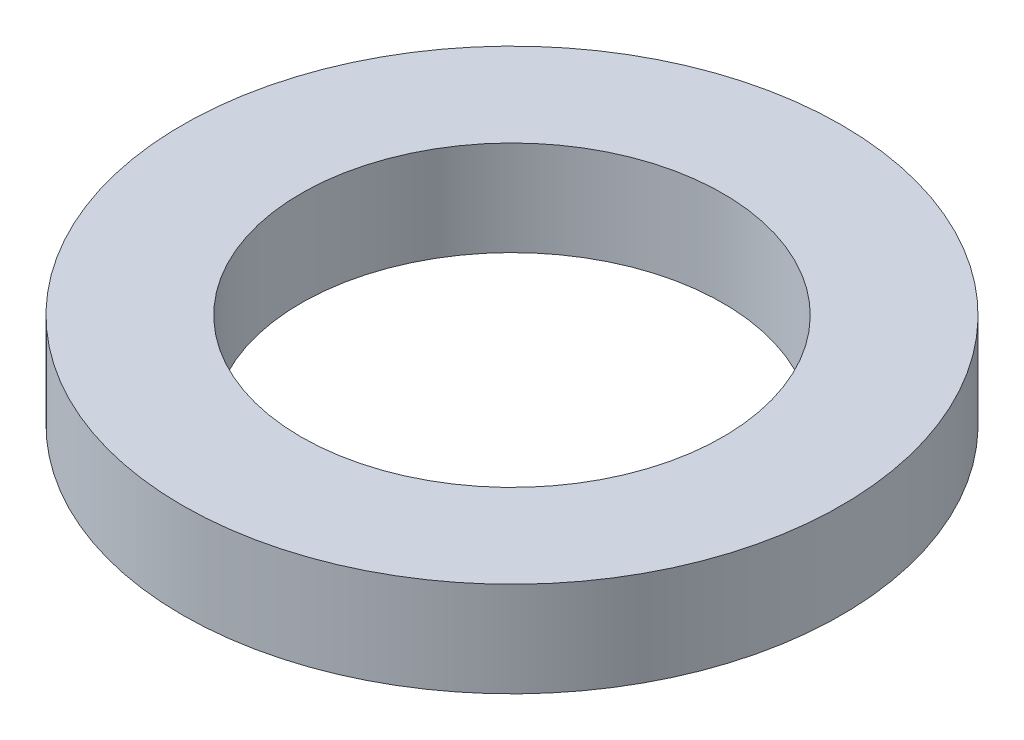
ISO-10303-21;
HEADER;
FILE_DESCRIPTION(('STEP AP214'),'2;1');
FILE_NAME('part.step','',(''),(''),'','','');
FILE_SCHEMA(('AUTOMOTIVE_DESIGN { 1 0 10303 214 1 1 1 1 }'));
ENDSEC;
DATA;
#1=APPLICATION_CONTEXT('core data for automotive mechanical design processes');
#2=APPLICATION_PROTOCOL_DEFINITION('international standard','automotive_design',2000,#1);
#3=PRODUCT_CONTEXT('',#1,'mechanical');
#4=PRODUCT('Part','Part','',(#3));
#5=PRODUCT_RELATED_PRODUCT_CATEGORY('part','',(#4));
#6=PRODUCT_DEFINITION_FORMATION('','',#4);
#7=PRODUCT_DEFINITION_CONTEXT('part definition',#1,'design');
#8=PRODUCT_DEFINITION('design','',#6,#7);
#9=PRODUCT_DEFINITION_SHAPE('','',#8);
#10=(LENGTH_UNIT() NAMED_UNIT(*) SI_UNIT(.MILLI.,.METRE.));
#11=(NAMED_UNIT(*) PLANE_ANGLE_UNIT() SI_UNIT($,.RADIAN.));
#12=(NAMED_UNIT(*) SI_UNIT($,.STERADIAN.) SOLID_ANGLE_UNIT());
#13=UNCERTAINTY_MEASURE_WITH_UNIT(LENGTH_MEASURE(1.E-05),#10,'distance_accuracy_value','');
#14=(GEOMETRIC_REPRESENTATION_CONTEXT(3) GLOBAL_UNCERTAINTY_ASSIGNED_CONTEXT((#13)) GLOBAL_UNIT_ASSIGNED_CONTEXT((#10,
#11,#12)) REPRESENTATION_CONTEXT('',''));
#15=CARTESIAN_POINT('',(0.,0.,0.));
#16=DIRECTION('',(0.,0.,1.));
#17=DIRECTION('',(1.,0.,0.));
#18=AXIS2_PLACEMENT_3D('',#15,#16,#17);
#19=CARTESIAN_POINT('',(0.,18.,0.));
#20=DIRECTION('',(0.,-1.,0.));
#21=DIRECTION('',(0.,0.,-1.));
#22=AXIS2_PLACEMENT_3D('',#19,#20,#21);
#23=CYLINDRICAL_SURFACE('',#22,62.5);
#24=CARTESIAN_POINT('',(0.,18.,0.));
#25=DIRECTION('',(0.,1.,0.));
#26=DIRECTION('',(0.,0.,1.));
#27=AXIS2_PLACEMENT_3D('',#24,#25,#26);
#28=CIRCLE('',#27,62.5);
#29=CARTESIAN_POINT('',(0.,18.,62.5));
#30=VERTEX_POINT('',#29);
#31=EDGE_CURVE('E10',#30,#30,#28,.T.);
#32=ORIENTED_EDGE('',*,*,#31,.F.);
#33=EDGE_LOOP('',(#32));
#34=FACE_BOUND('',#33,.T.);
#35=CARTESIAN_POINT('',(0.,0.,0.));
#36=DIRECTION('',(0.,1.,0.));
#37=DIRECTION('',(0.,0.,1.));
#38=AXIS2_PLACEMENT_3D('',#35,#36,#37);
#39=CIRCLE('',#38,62.5);
#40=CARTESIAN_POINT('',(0.,0.,62.5));
#41=VERTEX_POINT('',#40);
#42=EDGE_CURVE('E37',#41,#41,#39,.T.);
#43=ORIENTED_EDGE('',*,*,#42,.T.);
#44=EDGE_LOOP('',(#43));
#45=FACE_BOUND('',#44,.T.);
#46=ADVANCED_FACE('F40',(#34,#45),#23,.T.);
#47=CARTESIAN_POINT('',(0.,18.,0.));
#48=DIRECTION('',(0.,1.,0.));
#49=DIRECTION('',(0.,0.,1.));
#50=AXIS2_PLACEMENT_3D('',#47,#48,#49);
#51=PLANE('',#50);
#52=CARTESIAN_POINT('',(0.,18.,0.));
#53=DIRECTION('',(0.,1.,0.));
#54=DIRECTION('',(0.,0.,1.));
#55=AXIS2_PLACEMENT_3D('',#52,#53,#54);
#56=CIRCLE('',#55,40.);
#57=CARTESIAN_POINT('',(0.,18.,40.));
#58=VERTEX_POINT('',#57);
#59=EDGE_CURVE('E50',#58,#58,#56,.T.);
#60=ORIENTED_EDGE('',*,*,#59,.F.);
#61=EDGE_LOOP('',(#60));
#62=FACE_BOUND('',#61,.T.);
#63=ORIENTED_EDGE('',*,*,#31,.T.);
#64=EDGE_LOOP('',(#63));
#65=FACE_BOUND('',#64,.T.);
#66=ADVANCED_FACE('F59',(#62,#65),#51,.T.);
#67=CARTESIAN_POINT('',(0.,0.,0.));
#68=DIRECTION('',(0.,1.,0.));
#69=DIRECTION('',(0.,0.,1.));
#70=AXIS2_PLACEMENT_3D('',#67,#68,#69);
#71=PLANE('',#70);
#72=CARTESIAN_POINT('',(0.,0.,0.));
#73=DIRECTION('',(0.,1.,0.));
#74=DIRECTION('',(0.,0.,1.));
#75=AXIS2_PLACEMENT_3D('',#72,#73,#74);
#76=CIRCLE('',#75,40.);
#77=CARTESIAN_POINT('',(0.,0.,40.));
#78=VERTEX_POINT('',#77);
#79=EDGE_CURVE('E47',#78,#78,#76,.T.);
#80=ORIENTED_EDGE('',*,*,#79,.T.);
#81=EDGE_LOOP('',(#80));
#82=FACE_BOUND('',#81,.T.);
#83=ORIENTED_EDGE('',*,*,#42,.F.);
#84=EDGE_LOOP('',(#83));
#85=FACE_BOUND('',#84,.T.);
#86=ADVANCED_FACE('F58',(#82,#85),#71,.F.);
#87=CARTESIAN_POINT('',(0.,18.,0.));
#88=DIRECTION('',(0.,-1.,0.));
#89=DIRECTION('',(0.,0.,-1.));
#90=AXIS2_PLACEMENT_3D('',#87,#88,#89);
#91=CYLINDRICAL_SURFACE('',#90,40.);
#92=ORIENTED_EDGE('',*,*,#59,.T.);
#93=EDGE_LOOP('',(#92));
#94=FACE_BOUND('',#93,.T.);
#95=ORIENTED_EDGE('',*,*,#79,.F.);
#96=EDGE_LOOP('',(#95));
#97=FACE_BOUND('',#96,.T.);
#98=ADVANCED_FACE('F54',(#94,#97),#91,.F.);
#99=CLOSED_SHELL('',(#46,#66,#86,#98));
#100=MANIFOLD_SOLID_BREP('B2',#99);
#101=ADVANCED_BREP_SHAPE_REPRESENTATION('',(#18,#100),#14);
#102=SHAPE_DEFINITION_REPRESENTATION(#9,#101);
ENDSEC;
END-ISO-10303-21;
